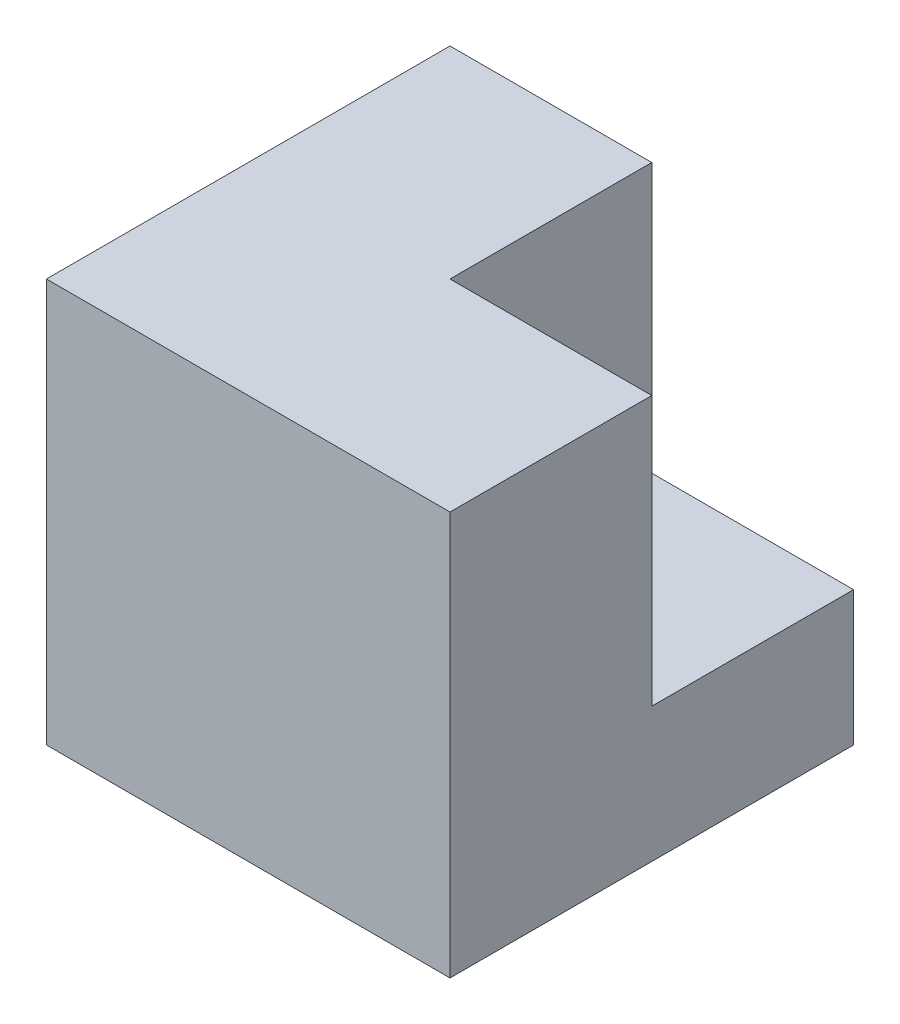
ISO-10303-21;
HEADER;
FILE_DESCRIPTION(('STEP AP214'),'2;1');
FILE_NAME('part.step','',(''),(''),'','','');
FILE_SCHEMA(('AUTOMOTIVE_DESIGN { 1 0 10303 214 1 1 1 1 }'));
ENDSEC;
DATA;
#1=APPLICATION_CONTEXT('core data for automotive mechanical design processes');
#2=APPLICATION_PROTOCOL_DEFINITION('international standard','automotive_design',2000,#1);
#3=PRODUCT_CONTEXT('',#1,'mechanical');
#4=PRODUCT('Part','Part','',(#3));
#5=PRODUCT_RELATED_PRODUCT_CATEGORY('part','',(#4));
#6=PRODUCT_DEFINITION_FORMATION('','',#4);
#7=PRODUCT_DEFINITION_CONTEXT('part definition',#1,'design');
#8=PRODUCT_DEFINITION('design','',#6,#7);
#9=PRODUCT_DEFINITION_SHAPE('','',#8);
#10=(LENGTH_UNIT() NAMED_UNIT(*) SI_UNIT(.MILLI.,.METRE.));
#11=(NAMED_UNIT(*) PLANE_ANGLE_UNIT() SI_UNIT($,.RADIAN.));
#12=(NAMED_UNIT(*) SI_UNIT($,.STERADIAN.) SOLID_ANGLE_UNIT());
#13=UNCERTAINTY_MEASURE_WITH_UNIT(LENGTH_MEASURE(1.E-05),#10,'distance_accuracy_value','');
#14=(GEOMETRIC_REPRESENTATION_CONTEXT(3) GLOBAL_UNCERTAINTY_ASSIGNED_CONTEXT((#13)) GLOBAL_UNIT_ASSIGNED_CONTEXT((#10,
#11,#12)) REPRESENTATION_CONTEXT('',''));
#15=CARTESIAN_POINT('',(0.,0.,0.));
#16=DIRECTION('',(0.,0.,1.));
#17=DIRECTION('',(1.,0.,0.));
#18=AXIS2_PLACEMENT_3D('',#15,#16,#17);
#19=CARTESIAN_POINT('',(0.,0.,76.2));
#20=DIRECTION('',(1.,0.,0.));
#21=DIRECTION('',(0.,0.,-1.));
#22=AXIS2_PLACEMENT_3D('',#19,#20,#21);
#23=PLANE('',#22);
#24=DIRECTION('',(0.,-1.,0.));
#25=VECTOR('',#24,1.);
#26=CARTESIAN_POINT('',(0.,0.,0.));
#27=LINE('',#26,#25);
#28=CARTESIAN_POINT('',(0.,76.2,0.));
#29=VERTEX_POINT('',#28);
#30=CARTESIAN_POINT('',(0.,0.,0.));
#31=VERTEX_POINT('',#30);
#32=EDGE_CURVE('E125',#29,#31,#27,.T.);
#33=ORIENTED_EDGE('',*,*,#32,.T.);
#34=DIRECTION('',(0.,0.,-1.));
#35=VECTOR('',#34,1.);
#36=CARTESIAN_POINT('',(0.,0.,76.2));
#37=LINE('',#36,#35);
#38=CARTESIAN_POINT('',(0.,0.,76.2));
#39=VERTEX_POINT('',#38);
#40=EDGE_CURVE('E11',#39,#31,#37,.T.);
#41=ORIENTED_EDGE('',*,*,#40,.F.);
#42=DIRECTION('',(0.,-1.,0.));
#43=VECTOR('',#42,1.);
#44=CARTESIAN_POINT('',(0.,0.,76.2));
#45=LINE('',#44,#43);
#46=CARTESIAN_POINT('',(0.,76.2,76.2));
#47=VERTEX_POINT('',#46);
#48=EDGE_CURVE('E127',#47,#39,#45,.T.);
#49=ORIENTED_EDGE('',*,*,#48,.F.);
#50=DIRECTION('',(0.,0.,-1.));
#51=VECTOR('',#50,1.);
#52=CARTESIAN_POINT('',(0.,76.2,76.2));
#53=LINE('',#52,#51);
#54=EDGE_CURVE('E138',#47,#29,#53,.T.);
#55=ORIENTED_EDGE('',*,*,#54,.T.);
#56=EDGE_LOOP('',(#33,#41,#49,#55));
#57=FACE_BOUND('',#56,.T.);
#58=ADVANCED_FACE('F39',(#57),#23,.F.);
#59=CARTESIAN_POINT('',(0.,0.,76.2));
#60=DIRECTION('',(0.,1.,0.));
#61=DIRECTION('',(-1.,0.,0.));
#62=AXIS2_PLACEMENT_3D('',#59,#60,#61);
#63=PLANE('',#62);
#64=DIRECTION('',(1.,0.,0.));
#65=VECTOR('',#64,1.);
#66=CARTESIAN_POINT('',(0.,0.,0.));
#67=LINE('',#66,#65);
#68=CARTESIAN_POINT('',(76.2,0.,0.));
#69=VERTEX_POINT('',#68);
#70=EDGE_CURVE('E134',#31,#69,#67,.T.);
#71=ORIENTED_EDGE('',*,*,#70,.T.);
#72=DIRECTION('',(0.,0.,-1.));
#73=VECTOR('',#72,1.);
#74=CARTESIAN_POINT('',(76.2,0.,76.2));
#75=LINE('',#74,#73);
#76=CARTESIAN_POINT('',(76.2,0.,76.2));
#77=VERTEX_POINT('',#76);
#78=EDGE_CURVE('E47',#77,#69,#75,.T.);
#79=ORIENTED_EDGE('',*,*,#78,.F.);
#80=DIRECTION('',(1.,0.,0.));
#81=VECTOR('',#80,1.);
#82=CARTESIAN_POINT('',(0.,0.,76.2));
#83=LINE('',#82,#81);
#84=EDGE_CURVE('E88',#39,#77,#83,.T.);
#85=ORIENTED_EDGE('',*,*,#84,.F.);
#86=ORIENTED_EDGE('',*,*,#40,.T.);
#87=EDGE_LOOP('',(#71,#79,#85,#86));
#88=FACE_BOUND('',#87,.T.);
#89=ADVANCED_FACE('F172',(#88),#63,.F.);
#90=CARTESIAN_POINT('',(76.2,0.,76.2));
#91=DIRECTION('',(-1.,0.,0.));
#92=DIRECTION('',(0.,0.,1.));
#93=AXIS2_PLACEMENT_3D('',#90,#91,#92);
#94=PLANE('',#93);
#95=DIRECTION('',(0.,1.,0.));
#96=VECTOR('',#95,1.);
#97=CARTESIAN_POINT('',(76.2,0.,0.));
#98=LINE('',#97,#96);
#99=CARTESIAN_POINT('',(76.2,25.4,0.));
#100=VERTEX_POINT('',#99);
#101=EDGE_CURVE('E128',#69,#100,#98,.T.);
#102=ORIENTED_EDGE('',*,*,#101,.T.);
#103=DIRECTION('',(0.,0.,-1.));
#104=VECTOR('',#103,1.);
#105=CARTESIAN_POINT('',(76.2,25.4,0.));
#106=LINE('',#105,#104);
#107=CARTESIAN_POINT('',(76.2,25.4,38.1));
#108=VERTEX_POINT('',#107);
#109=EDGE_CURVE('E114',#108,#100,#106,.T.);
#110=ORIENTED_EDGE('',*,*,#109,.F.);
#111=DIRECTION('',(0.,-1.,0.));
#112=VECTOR('',#111,1.);
#113=CARTESIAN_POINT('',(76.2,76.2,38.1));
#114=LINE('',#113,#112);
#115=CARTESIAN_POINT('',(76.2,76.2,38.1));
#116=VERTEX_POINT('',#115);
#117=EDGE_CURVE('E178',#116,#108,#114,.T.);
#118=ORIENTED_EDGE('',*,*,#117,.F.);
#119=DIRECTION('',(0.,0.,-1.));
#120=VECTOR('',#119,1.);
#121=CARTESIAN_POINT('',(76.2,76.2,76.2));
#122=LINE('',#121,#120);
#123=CARTESIAN_POINT('',(76.2,76.2,76.2));
#124=VERTEX_POINT('',#123);
#125=EDGE_CURVE('E141',#124,#116,#122,.T.);
#126=ORIENTED_EDGE('',*,*,#125,.F.);
#127=DIRECTION('',(0.,1.,0.));
#128=VECTOR('',#127,1.);
#129=CARTESIAN_POINT('',(76.2,0.,76.2));
#130=LINE('',#129,#128);
#131=EDGE_CURVE('E151',#77,#124,#130,.T.);
#132=ORIENTED_EDGE('',*,*,#131,.F.);
#133=ORIENTED_EDGE('',*,*,#78,.T.);
#134=EDGE_LOOP('',(#102,#110,#118,#126,#132,#133));
#135=FACE_BOUND('',#134,.T.);
#136=ADVANCED_FACE('F148',(#135),#94,.F.);
#137=CARTESIAN_POINT('',(0.,76.2,76.2));
#138=DIRECTION('',(0.,-1.,0.));
#139=DIRECTION('',(1.,0.,0.));
#140=AXIS2_PLACEMENT_3D('',#137,#138,#139);
#141=PLANE('',#140);
#142=ORIENTED_EDGE('',*,*,#125,.T.);
#143=DIRECTION('',(1.,0.,0.));
#144=VECTOR('',#143,1.);
#145=CARTESIAN_POINT('',(38.1,76.2,38.1));
#146=LINE('',#145,#144);
#147=CARTESIAN_POINT('',(38.1,76.2,38.1));
#148=VERTEX_POINT('',#147);
#149=EDGE_CURVE('E118',#148,#116,#146,.T.);
#150=ORIENTED_EDGE('',*,*,#149,.F.);
#151=DIRECTION('',(0.,0.,1.));
#152=VECTOR('',#151,1.);
#153=CARTESIAN_POINT('',(38.1,76.2,0.));
#154=LINE('',#153,#152);
#155=CARTESIAN_POINT('',(38.1,76.2,0.));
#156=VERTEX_POINT('',#155);
#157=EDGE_CURVE('E109',#156,#148,#154,.T.);
#158=ORIENTED_EDGE('',*,*,#157,.F.);
#159=DIRECTION('',(-1.,0.,0.));
#160=VECTOR('',#159,1.);
#161=CARTESIAN_POINT('',(0.,76.2,0.));
#162=LINE('',#161,#160);
#163=EDGE_CURVE('E81',#156,#29,#162,.T.);
#164=ORIENTED_EDGE('',*,*,#163,.T.);
#165=ORIENTED_EDGE('',*,*,#54,.F.);
#166=DIRECTION('',(-1.,0.,0.));
#167=VECTOR('',#166,1.);
#168=CARTESIAN_POINT('',(0.,76.2,76.2));
#169=LINE('',#168,#167);
#170=EDGE_CURVE('E63',#124,#47,#169,.T.);
#171=ORIENTED_EDGE('',*,*,#170,.F.);
#172=EDGE_LOOP('',(#142,#150,#158,#164,#165,#171));
#173=FACE_BOUND('',#172,.T.);
#174=ADVANCED_FACE('F117',(#173),#141,.F.);
#175=CARTESIAN_POINT('',(0.,0.,76.2));
#176=DIRECTION('',(0.,0.,-1.));
#177=DIRECTION('',(-1.,0.,0.));
#178=AXIS2_PLACEMENT_3D('',#175,#176,#177);
#179=PLANE('',#178);
#180=ORIENTED_EDGE('',*,*,#48,.T.);
#181=ORIENTED_EDGE('',*,*,#84,.T.);
#182=ORIENTED_EDGE('',*,*,#131,.T.);
#183=ORIENTED_EDGE('',*,*,#170,.T.);
#184=EDGE_LOOP('',(#180,#181,#182,#183));
#185=FACE_BOUND('',#184,.T.);
#186=ADVANCED_FACE('F208',(#185),#179,.F.);
#187=CARTESIAN_POINT('',(0.,0.,0.));
#188=DIRECTION('',(0.,0.,-1.));
#189=DIRECTION('',(-1.,0.,0.));
#190=AXIS2_PLACEMENT_3D('',#187,#188,#189);
#191=PLANE('',#190);
#192=DIRECTION('',(1.,0.,0.));
#193=VECTOR('',#192,1.);
#194=CARTESIAN_POINT('',(38.1,25.4,0.));
#195=LINE('',#194,#193);
#196=CARTESIAN_POINT('',(38.1,25.4,0.));
#197=VERTEX_POINT('',#196);
#198=EDGE_CURVE('E152',#197,#100,#195,.T.);
#199=ORIENTED_EDGE('',*,*,#198,.T.);
#200=ORIENTED_EDGE('',*,*,#101,.F.);
#201=ORIENTED_EDGE('',*,*,#70,.F.);
#202=ORIENTED_EDGE('',*,*,#32,.F.);
#203=ORIENTED_EDGE('',*,*,#163,.F.);
#204=DIRECTION('',(0.,1.,0.));
#205=VECTOR('',#204,1.);
#206=CARTESIAN_POINT('',(38.1,76.2,0.));
#207=LINE('',#206,#205);
#208=EDGE_CURVE('E107',#197,#156,#207,.T.);
#209=ORIENTED_EDGE('',*,*,#208,.F.);
#210=EDGE_LOOP('',(#199,#200,#201,#202,#203,#209));
#211=FACE_BOUND('',#210,.T.);
#212=ADVANCED_FACE('F123',(#211),#191,.T.);
#213=CARTESIAN_POINT('',(38.1,25.4,0.));
#214=DIRECTION('',(0.,-1.,0.));
#215=DIRECTION('',(0.,0.,-1.));
#216=AXIS2_PLACEMENT_3D('',#213,#214,#215);
#217=PLANE('',#216);
#218=ORIENTED_EDGE('',*,*,#109,.T.);
#219=ORIENTED_EDGE('',*,*,#198,.F.);
#220=DIRECTION('',(0.,0.,-1.));
#221=VECTOR('',#220,1.);
#222=CARTESIAN_POINT('',(38.1,25.4,0.));
#223=LINE('',#222,#221);
#224=CARTESIAN_POINT('',(38.1,25.4,38.1));
#225=VERTEX_POINT('',#224);
#226=EDGE_CURVE('E54',#225,#197,#223,.T.);
#227=ORIENTED_EDGE('',*,*,#226,.F.);
#228=DIRECTION('',(1.,0.,0.));
#229=VECTOR('',#228,1.);
#230=CARTESIAN_POINT('',(38.1,25.4,38.1));
#231=LINE('',#230,#229);
#232=EDGE_CURVE('E155',#225,#108,#231,.T.);
#233=ORIENTED_EDGE('',*,*,#232,.T.);
#234=EDGE_LOOP('',(#218,#219,#227,#233));
#235=FACE_BOUND('',#234,.T.);
#236=ADVANCED_FACE('F186',(#235),#217,.F.);
#237=CARTESIAN_POINT('',(38.1,76.2,38.1));
#238=DIRECTION('',(0.,0.,1.));
#239=DIRECTION('',(0.,-1.,0.));
#240=AXIS2_PLACEMENT_3D('',#237,#238,#239);
#241=PLANE('',#240);
#242=ORIENTED_EDGE('',*,*,#117,.T.);
#243=ORIENTED_EDGE('',*,*,#232,.F.);
#244=DIRECTION('',(0.,-1.,0.));
#245=VECTOR('',#244,1.);
#246=CARTESIAN_POINT('',(38.1,76.2,38.1));
#247=LINE('',#246,#245);
#248=EDGE_CURVE('E120',#148,#225,#247,.T.);
#249=ORIENTED_EDGE('',*,*,#248,.F.);
#250=ORIENTED_EDGE('',*,*,#149,.T.);
#251=EDGE_LOOP('',(#242,#243,#249,#250));
#252=FACE_BOUND('',#251,.T.);
#253=ADVANCED_FACE('F187',(#252),#241,.F.);
#254=CARTESIAN_POINT('',(38.1,0.,0.));
#255=DIRECTION('',(-1.,0.,0.));
#256=DIRECTION('',(0.,0.,1.));
#257=AXIS2_PLACEMENT_3D('',#254,#255,#256);
#258=PLANE('',#257);
#259=ORIENTED_EDGE('',*,*,#208,.T.);
#260=ORIENTED_EDGE('',*,*,#157,.T.);
#261=ORIENTED_EDGE('',*,*,#248,.T.);
#262=ORIENTED_EDGE('',*,*,#226,.T.);
#263=EDGE_LOOP('',(#259,#260,#261,#262));
#264=FACE_BOUND('',#263,.T.);
#265=ADVANCED_FACE('F108',(#264),#258,.F.);
#266=CLOSED_SHELL('',(#58,#89,#136,#174,#186,#212,#236,#253,#265));
#267=MANIFOLD_SOLID_BREP('B2',#266);
#268=ADVANCED_BREP_SHAPE_REPRESENTATION('',(#18,#267),#14);
#269=SHAPE_DEFINITION_REPRESENTATION(#9,#268);
ENDSEC;
END-ISO-10303-21;
